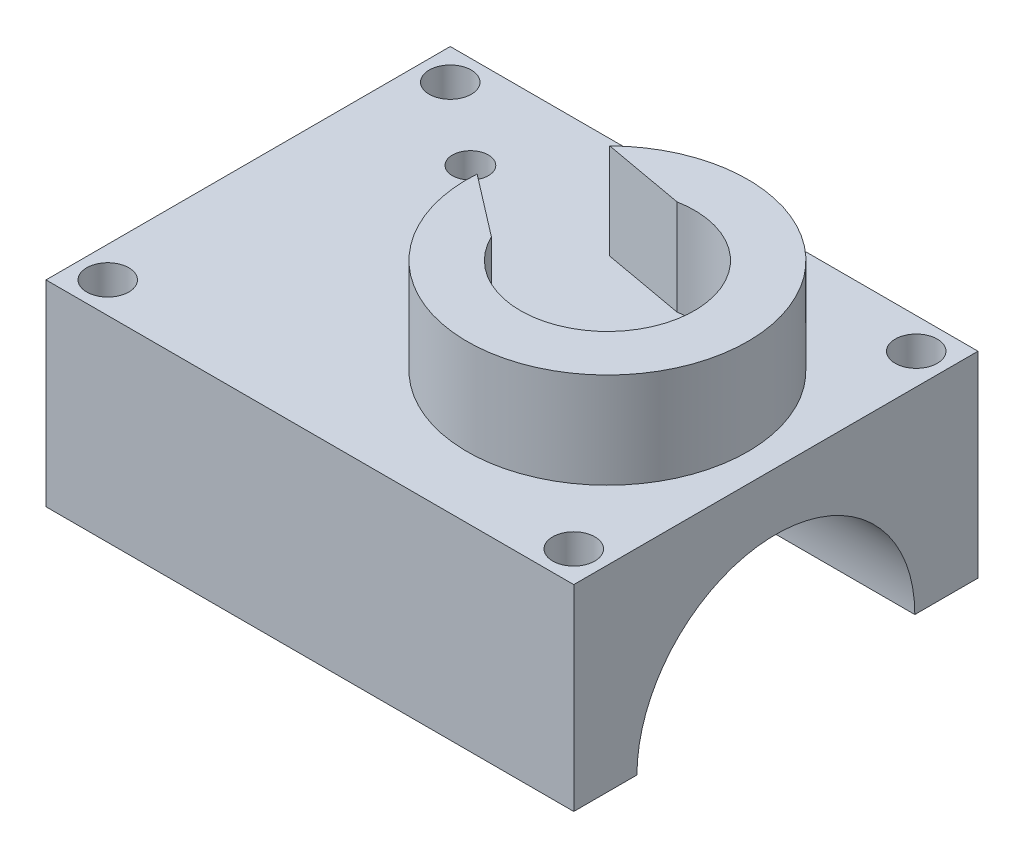
ISO-10303-21;
HEADER;
FILE_DESCRIPTION(('STEP AP214'),'2;1');
FILE_NAME('part.step','',(''),(''),'','','');
FILE_SCHEMA(('AUTOMOTIVE_DESIGN { 1 0 10303 214 1 1 1 1 }'));
ENDSEC;
DATA;
#1=APPLICATION_CONTEXT('core data for automotive mechanical design processes');
#2=APPLICATION_PROTOCOL_DEFINITION('international standard','automotive_design',2000,#1);
#3=PRODUCT_CONTEXT('',#1,'mechanical');
#4=PRODUCT('Part','Part','',(#3));
#5=PRODUCT_RELATED_PRODUCT_CATEGORY('part','',(#4));
#6=PRODUCT_DEFINITION_FORMATION('','',#4);
#7=PRODUCT_DEFINITION_CONTEXT('part definition',#1,'design');
#8=PRODUCT_DEFINITION('design','',#6,#7);
#9=PRODUCT_DEFINITION_SHAPE('','',#8);
#10=(LENGTH_UNIT() NAMED_UNIT(*) SI_UNIT(.MILLI.,.METRE.));
#11=(NAMED_UNIT(*) PLANE_ANGLE_UNIT() SI_UNIT($,.RADIAN.));
#12=(NAMED_UNIT(*) SI_UNIT($,.STERADIAN.) SOLID_ANGLE_UNIT());
#13=UNCERTAINTY_MEASURE_WITH_UNIT(LENGTH_MEASURE(1.E-05),#10,'distance_accuracy_value','');
#14=(GEOMETRIC_REPRESENTATION_CONTEXT(3) GLOBAL_UNCERTAINTY_ASSIGNED_CONTEXT((#13)) GLOBAL_UNIT_ASSIGNED_CONTEXT((#10,
#11,#12)) REPRESENTATION_CONTEXT('',''));
#15=CARTESIAN_POINT('',(0.,0.,0.));
#16=DIRECTION('',(0.,0.,1.));
#17=DIRECTION('',(1.,0.,0.));
#18=AXIS2_PLACEMENT_3D('',#15,#16,#17);
#19=CARTESIAN_POINT('',(-30.,35.,-18.));
#20=DIRECTION('',(0.,0.,1.));
#21=DIRECTION('',(1.,0.,0.));
#22=AXIS2_PLACEMENT_3D('',#19,#20,#21);
#23=PLANE('',#22);
#24=DIRECTION('',(0.,-1.,0.));
#25=VECTOR('',#24,1.);
#26=CARTESIAN_POINT('',(-17.,35.,-18.));
#27=LINE('',#26,#25);
#28=CARTESIAN_POINT('',(-17.,35.,-18.));
#29=VERTEX_POINT('',#28);
#30=CARTESIAN_POINT('',(-17.,17.5,-18.));
#31=VERTEX_POINT('',#30);
#32=EDGE_CURVE('E297',#29,#31,#27,.T.);
#33=ORIENTED_EDGE('',*,*,#32,.F.);
#34=DIRECTION('',(-1.,0.,0.));
#35=VECTOR('',#34,1.);
#36=CARTESIAN_POINT('',(-30.,35.,-18.));
#37=LINE('',#36,#35);
#38=CARTESIAN_POINT('',(30.,35.,-18.));
#39=VERTEX_POINT('',#38);
#40=EDGE_CURVE('E204',#39,#29,#37,.T.);
#41=ORIENTED_EDGE('',*,*,#40,.F.);
#42=DIRECTION('',(0.,-1.,0.));
#43=VECTOR('',#42,1.);
#44=CARTESIAN_POINT('',(30.,35.,-18.));
#45=LINE('',#44,#43);
#46=CARTESIAN_POINT('',(30.,17.5,-18.));
#47=VERTEX_POINT('',#46);
#48=EDGE_CURVE('E210',#39,#47,#45,.T.);
#49=ORIENTED_EDGE('',*,*,#48,.T.);
#50=DIRECTION('',(1.,0.,0.));
#51=VECTOR('',#50,1.);
#52=CARTESIAN_POINT('',(-30.,17.5,-18.));
#53=LINE('',#52,#51);
#54=EDGE_CURVE('E164',#31,#47,#53,.T.);
#55=ORIENTED_EDGE('',*,*,#54,.F.);
#56=EDGE_LOOP('',(#33,#41,#49,#55));
#57=FACE_BOUND('',#56,.T.);
#58=ADVANCED_FACE('F47',(#57),#23,.F.);
#59=CARTESIAN_POINT('',(-30.,35.,18.));
#60=DIRECTION('',(0.,0.,-1.));
#61=DIRECTION('',(-1.,0.,0.));
#62=AXIS2_PLACEMENT_3D('',#59,#60,#61);
#63=PLANE('',#62);
#64=DIRECTION('',(0.,1.,0.));
#65=VECTOR('',#64,1.);
#66=CARTESIAN_POINT('',(-17.,35.,18.));
#67=LINE('',#66,#65);
#68=CARTESIAN_POINT('',(-17.,17.5,18.));
#69=VERTEX_POINT('',#68);
#70=CARTESIAN_POINT('',(-17.,35.,18.));
#71=VERTEX_POINT('',#70);
#72=EDGE_CURVE('E146',#69,#71,#67,.T.);
#73=ORIENTED_EDGE('',*,*,#72,.F.);
#74=DIRECTION('',(1.,0.,0.));
#75=VECTOR('',#74,1.);
#76=CARTESIAN_POINT('',(-30.,17.5,18.));
#77=LINE('',#76,#75);
#78=CARTESIAN_POINT('',(30.,17.5,18.));
#79=VERTEX_POINT('',#78);
#80=EDGE_CURVE('E155',#69,#79,#77,.T.);
#81=ORIENTED_EDGE('',*,*,#80,.T.);
#82=DIRECTION('',(0.,-1.,0.));
#83=VECTOR('',#82,1.);
#84=CARTESIAN_POINT('',(30.,35.,18.));
#85=LINE('',#84,#83);
#86=CARTESIAN_POINT('',(30.,35.,18.));
#87=VERTEX_POINT('',#86);
#88=EDGE_CURVE('E208',#87,#79,#85,.T.);
#89=ORIENTED_EDGE('',*,*,#88,.F.);
#90=DIRECTION('',(1.,0.,0.));
#91=VECTOR('',#90,1.);
#92=CARTESIAN_POINT('',(-30.,35.,18.));
#93=LINE('',#92,#91);
#94=EDGE_CURVE('E157',#71,#87,#93,.T.);
#95=ORIENTED_EDGE('',*,*,#94,.F.);
#96=EDGE_LOOP('',(#73,#81,#89,#95));
#97=FACE_BOUND('',#96,.T.);
#98=ADVANCED_FACE('F153',(#97),#63,.F.);
#99=CARTESIAN_POINT('',(0.,35.,0.));
#100=DIRECTION('',(0.,-1.,0.));
#101=DIRECTION('',(0.,0.,-1.));
#102=AXIS2_PLACEMENT_3D('',#99,#100,#101);
#103=PLANE('',#102);
#104=CARTESIAN_POINT('',(-14.25,35.,15.25));
#105=DIRECTION('',(0.,1.,0.));
#106=DIRECTION('',(0.,0.,-1.));
#107=AXIS2_PLACEMENT_3D('',#104,#105,#106);
#108=CIRCLE('',#107,1.875);
#109=CARTESIAN_POINT('',(-14.25,35.,13.375));
#110=VERTEX_POINT('',#109);
#111=EDGE_CURVE('E193',#110,#110,#108,.T.);
#112=ORIENTED_EDGE('',*,*,#111,.F.);
#113=EDGE_LOOP('',(#112));
#114=FACE_BOUND('',#113,.T.);
#115=CARTESIAN_POINT('',(27.25,35.,-15.25));
#116=DIRECTION('',(0.,1.,0.));
#117=DIRECTION('',(0.,0.,-1.));
#118=AXIS2_PLACEMENT_3D('',#115,#116,#117);
#119=CIRCLE('',#118,1.87500000000001);
#120=CARTESIAN_POINT('',(27.25,35.,-17.125));
#121=VERTEX_POINT('',#120);
#122=EDGE_CURVE('E186',#121,#121,#119,.T.);
#123=ORIENTED_EDGE('',*,*,#122,.F.);
#124=EDGE_LOOP('',(#123));
#125=FACE_BOUND('',#124,.T.);
#126=CARTESIAN_POINT('',(27.25,35.,15.25));
#127=DIRECTION('',(0.,1.,0.));
#128=DIRECTION('',(0.,0.,1.));
#129=AXIS2_PLACEMENT_3D('',#126,#127,#128);
#130=CIRCLE('',#129,1.875);
#131=CARTESIAN_POINT('',(27.25,35.,17.125));
#132=VERTEX_POINT('',#131);
#133=EDGE_CURVE('E189',#132,#132,#130,.T.);
#134=ORIENTED_EDGE('',*,*,#133,.F.);
#135=EDGE_LOOP('',(#134));
#136=FACE_BOUND('',#135,.T.);
#137=CARTESIAN_POINT('',(-14.25,35.,-15.25));
#138=DIRECTION('',(0.,1.,0.));
#139=DIRECTION('',(0.,0.,1.));
#140=AXIS2_PLACEMENT_3D('',#137,#138,#139);
#141=CIRCLE('',#140,1.87500000000001);
#142=CARTESIAN_POINT('',(-14.25,35.,-13.375));
#143=VERTEX_POINT('',#142);
#144=EDGE_CURVE('E190',#143,#143,#141,.T.);
#145=ORIENTED_EDGE('',*,*,#144,.F.);
#146=EDGE_LOOP('',(#145));
#147=FACE_BOUND('',#146,.T.);
#148=CARTESIAN_POINT('',(-6.93780068742045,35.,-9.73308281065229));
#149=DIRECTION('',(0.,1.,0.));
#150=DIRECTION('',(0.,0.,1.));
#151=AXIS2_PLACEMENT_3D('',#148,#149,#150);
#152=CIRCLE('',#151,1.6);
#153=CARTESIAN_POINT('',(-6.93780068742045,35.,-8.13308281065229));
#154=VERTEX_POINT('',#153);
#155=EDGE_CURVE('E287',#154,#154,#152,.T.);
#156=ORIENTED_EDGE('',*,*,#155,.F.);
#157=EDGE_LOOP('',(#156));
#158=FACE_BOUND('',#157,.T.);
#159=DIRECTION('',(-0.984099357112576,0.,-0.177618848466636));
#160=VECTOR('',#159,1.);
#161=CARTESIAN_POINT('',(-6.31746052441174,35.,-11.2079313052979));
#162=LINE('',#161,#160);
#163=CARTESIAN_POINT('',(13.5741859363366,35.,-7.61771319070623));
#164=VERTEX_POINT('',#163);
#165=CARTESIAN_POINT('',(6.26109190714302,35.,-8.93764428384788));
#166=VERTEX_POINT('',#165);
#167=EDGE_CURVE('E291',#164,#166,#162,.T.);
#168=ORIENTED_EDGE('',*,*,#167,.T.);
#169=CARTESIAN_POINT('',(15.,35.,0.));
#170=DIRECTION('',(0.,-1.,0.));
#171=DIRECTION('',(0.,0.,-1.));
#172=AXIS2_PLACEMENT_3D('',#169,#170,#171);
#173=CIRCLE('',#172,12.5);
#174=CARTESIAN_POINT('',(2.52983012282543,35.,-0.863054595265051));
#175=VERTEX_POINT('',#174);
#176=EDGE_CURVE('E383',#175,#166,#173,.F.);
#177=ORIENTED_EDGE('',*,*,#176,.F.);
#178=DIRECTION('',(0.79314049072422,0.,0.609038719601426));
#179=VECTOR('',#178,1.);
#180=CARTESIAN_POINT('',(-6.93780068742045,35.,-8.13308281065229));
#181=LINE('',#180,#179);
#182=CARTESIAN_POINT('',(8.00854236660578,35.,3.34395277485401));
#183=VERTEX_POINT('',#182);
#184=EDGE_CURVE('E69',#175,#183,#181,.T.);
#185=ORIENTED_EDGE('',*,*,#184,.T.);
#186=CARTESIAN_POINT('',(15.,35.,0.));
#187=DIRECTION('',(0.,1.,0.));
#188=DIRECTION('',(0.,0.,1.));
#189=AXIS2_PLACEMENT_3D('',#186,#187,#188);
#190=CIRCLE('',#189,7.75);
#191=EDGE_CURVE('E317',#183,#164,#190,.T.);
#192=ORIENTED_EDGE('',*,*,#191,.T.);
#193=EDGE_LOOP('',(#168,#177,#185,#192));
#194=FACE_BOUND('',#193,.T.);
#195=CARTESIAN_POINT('',(15.,35.,0.));
#196=DIRECTION('',(0.,-1.,0.));
#197=DIRECTION('',(0.,0.,-1.));
#198=AXIS2_PLACEMENT_3D('',#195,#196,#197);
#199=CIRCLE('',#198,1.6);
#200=CARTESIAN_POINT('',(15.,35.,-1.6));
#201=VERTEX_POINT('',#200);
#202=EDGE_CURVE('E225',#201,#201,#199,.T.);
#203=ORIENTED_EDGE('',*,*,#202,.T.);
#204=EDGE_LOOP('',(#203));
#205=FACE_BOUND('',#204,.T.);
#206=DIRECTION('',(0.,0.,-1.));
#207=VECTOR('',#206,1.);
#208=CARTESIAN_POINT('',(-17.,35.,0.));
#209=LINE('',#208,#207);
#210=EDGE_CURVE('E296',#71,#29,#209,.T.);
#211=ORIENTED_EDGE('',*,*,#210,.F.);
#212=ORIENTED_EDGE('',*,*,#94,.T.);
#213=DIRECTION('',(0.,0.,-1.));
#214=VECTOR('',#213,1.);
#215=CARTESIAN_POINT('',(30.,35.,18.));
#216=LINE('',#215,#214);
#217=EDGE_CURVE('E201',#87,#39,#216,.T.);
#218=ORIENTED_EDGE('',*,*,#217,.T.);
#219=ORIENTED_EDGE('',*,*,#40,.T.);
#220=EDGE_LOOP('',(#211,#212,#218,#219));
#221=FACE_BOUND('',#220,.T.);
#222=ADVANCED_FACE('F268',(#114,#125,#136,#147,#158,#194,#205,#221),#103,.F.);
#223=CARTESIAN_POINT('',(-30.,17.5,0.));
#224=DIRECTION('',(1.,0.,0.));
#225=DIRECTION('',(0.,0.,-1.));
#226=AXIS2_PLACEMENT_3D('',#223,#224,#225);
#227=CYLINDRICAL_SURFACE('',#226,12.375);
#228=CARTESIAN_POINT('',(15.,29.5340101379382,-2.885));
#229=CARTESIAN_POINT('',(14.8403290783683,29.534013330723,-2.88499490173287));
#230=CARTESIAN_POINT('',(14.6805991342776,29.5372226374159,-2.87169934923319));
#231=CARTESIAN_POINT('',(14.3657014366662,29.5496854773321,-2.81893835112755));
#232=CARTESIAN_POINT('',(14.2105367638147,29.5589429984039,-2.77945563893693));
#233=CARTESIAN_POINT('',(13.9093700045626,29.5823981112321,-2.67564742877025));
#234=CARTESIAN_POINT('',(13.7633573161208,29.5965898572948,-2.61135131794787));
#235=CARTESIAN_POINT('',(13.4841821220057,29.6283072353214,-2.4598281164135));
#236=CARTESIAN_POINT('',(13.3510197172738,29.6458328934704,-2.37260084559319));
#237=CARTESIAN_POINT('',(13.098772537658,29.6826189610307,-2.17590796215374));
#238=CARTESIAN_POINT('',(12.979970093371,29.7019040718922,-2.06608483033001));
#239=CARTESIAN_POINT('',(12.7622943639026,29.7398207435714,-1.82808877246084));
#240=CARTESIAN_POINT('',(12.6634227624512,29.7584522490638,-1.69991429768239));
#241=CARTESIAN_POINT('',(12.4872813864765,29.79323340834,-1.42694248903819));
#242=CARTESIAN_POINT('',(12.4102857674632,29.809350511921,-1.28196374483246));
#243=CARTESIAN_POINT('',(12.281859589753,29.8370066412362,-0.98068494495937));
#244=CARTESIAN_POINT('',(12.2304257634973,29.8485462520722,-0.824386339235661));
#245=CARTESIAN_POINT('',(12.1554784788291,29.8655726086653,-0.507843852941573));
#246=CARTESIAN_POINT('',(12.1314864330716,29.8711629852995,-0.347718955998159));
#247=CARTESIAN_POINT('',(12.1106047816844,29.8760209672482,-0.0256259550440856));
#248=CARTESIAN_POINT('',(12.1137116719453,29.875289390042,0.136341907951378));
#249=CARTESIAN_POINT('',(12.1465886915227,29.8676641796498,0.454215052496489));
#250=CARTESIAN_POINT('',(12.1758426513784,29.8608898417953,0.610177007509724));
#251=CARTESIAN_POINT('',(12.2593576939323,29.8420774941503,0.914914728618146));
#252=CARTESIAN_POINT('',(12.3136200028653,29.8300392262548,1.06369014194028));
#253=CARTESIAN_POINT('',(12.446050494671,29.801863934318,1.35123188466526));
#254=CARTESIAN_POINT('',(12.5244089739195,29.7856944630647,1.48990726123099));
#255=CARTESIAN_POINT('',(12.7026645660478,29.7510214337998,1.75232545861638));
#256=CARTESIAN_POINT('',(12.8025649807702,29.7325175181566,1.87606598575529));
#257=CARTESIAN_POINT('',(13.0238600507216,29.6946870455019,2.10817619953594));
#258=CARTESIAN_POINT('',(13.1457062564299,29.6753513798745,2.21611430817536));
#259=CARTESIAN_POINT('',(13.4059721416776,29.63844145222,2.4101128944092));
#260=CARTESIAN_POINT('',(13.5443924030102,29.6208672520649,2.49617260368256));
#261=CARTESIAN_POINT('',(13.8346405703438,29.5894418768931,2.64420016193607));
#262=CARTESIAN_POINT('',(13.9865167386292,29.5756048885923,2.70607659590089));
#263=CARTESIAN_POINT('',(14.2989129487144,29.5534098326218,2.80329257371181));
#264=CARTESIAN_POINT('',(14.4594314044945,29.5450507633364,2.83863696900744));
#265=CARTESIAN_POINT('',(14.7805858465601,29.534965010041,2.88109557743742));
#266=CARTESIAN_POINT('',(14.9411336151261,29.5330897040742,2.88884251257696));
#267=CARTESIAN_POINT('',(15.2612269310516,29.5357812663334,2.87760788692816));
#268=CARTESIAN_POINT('',(15.4207725564968,29.5403476262193,2.85862843523725));
#269=CARTESIAN_POINT('',(15.7320650895613,29.5552667207741,2.79503144324121));
#270=CARTESIAN_POINT('',(15.8838892153943,29.56553876906,2.75077116722028));
#271=CARTESIAN_POINT('',(16.1779654997739,29.5906373540794,2.63825983426755));
#272=CARTESIAN_POINT('',(16.3202166402891,29.6054643742777,2.57000623057311));
#273=CARTESIAN_POINT('',(16.5938216735157,29.6383227262856,2.41008293791368));
#274=CARTESIAN_POINT('',(16.7249444726909,29.6564050545638,2.31802858254649));
#275=CARTESIAN_POINT('',(16.9701139340845,29.693606375162,2.11361257761502));
#276=CARTESIAN_POINT('',(17.0841581677716,29.7127255143886,2.00124804499597));
#277=CARTESIAN_POINT('',(17.2944365935378,29.7503422867359,1.75651982603345));
#278=CARTESIAN_POINT('',(17.3902365548706,29.7688178087208,1.62377903537295));
#279=CARTESIAN_POINT('',(17.5581804162691,29.8026377958843,1.34372319381795));
#280=CARTESIAN_POINT('',(17.6303254914707,29.8179824165866,1.19640886738621));
#281=CARTESIAN_POINT('',(17.7483308280084,29.8437195498961,0.892360514485398));
#282=CARTESIAN_POINT('',(17.7943692082165,29.854145536822,0.735698582949505));
#283=CARTESIAN_POINT('',(17.8594020920382,29.8690162739875,0.416590481353656));
#284=CARTESIAN_POINT('',(17.878401094331,29.8734620191837,0.254145278097031));
#285=CARTESIAN_POINT('',(17.8885908216136,29.8758368696912,-0.067815611239718));
#286=CARTESIAN_POINT('',(17.8804263978302,29.8739170941747,-0.227310106596556));
#287=CARTESIAN_POINT('',(17.8379788203858,29.8641054266419,-0.54258713351675));
#288=CARTESIAN_POINT('',(17.8036962660715,29.856213671668,-0.698369750173991));
#289=CARTESIAN_POINT('',(17.7103117389502,29.8353614929274,-1.00122317159058));
#290=CARTESIAN_POINT('',(17.6513125376116,29.8224220724417,-1.14832720503001));
#291=CARTESIAN_POINT('',(17.5102657009942,29.7928473740463,-1.43062802691732));
#292=CARTESIAN_POINT('',(17.4282155142212,29.7762116870426,-1.56582349503878));
#293=CARTESIAN_POINT('',(17.2413536025263,29.740608516578,-1.82357696180435));
#294=CARTESIAN_POINT('',(17.1360953209811,29.7215990008404,-1.9458054368098));
#295=CARTESIAN_POINT('',(16.9066910444062,29.6835996586578,-2.17108397217673));
#296=CARTESIAN_POINT('',(16.7825404113233,29.6646098382037,-2.2741293092478));
#297=CARTESIAN_POINT('',(16.5165367923883,29.6284654497227,-2.45968479525675));
#298=CARTESIAN_POINT('',(16.3744371396181,29.6113442601251,-2.54184827469139));
#299=CARTESIAN_POINT('',(16.0780701226495,29.5813073463044,-2.68099656170731));
#300=CARTESIAN_POINT('',(15.9238125406776,29.5683882831233,-2.73800137297497));
#301=CARTESIAN_POINT('',(15.6413140283395,29.5504449373968,-2.81577987298684));
#302=CARTESIAN_POINT('',(15.5145306262997,29.5443251576512,-2.84168470892808));
#303=CARTESIAN_POINT('',(15.2585109422719,29.5361065925551,-2.87629629257412));
#304=CARTESIAN_POINT('',(15.1292748159026,29.534007552955,-2.8850041277243));
#305=CARTESIAN_POINT('',(15.,29.5340101379382,-2.885));
#306=B_SPLINE_CURVE_WITH_KNOTS('',3,(#228,#229,#230,#231,#232,#233,#234,#235,#236,#237,#238,
#239,#240,#241,#242,#243,#244,#245,#246,#247,#248,#249,#250,#251,#252,#253,#254,#255,#256,#257,
#258,#259,#260,#261,#262,#263,#264,#265,#266,#267,#268,#269,#270,#271,#272,#273,#274,#275,#276,
#277,#278,#279,#280,#281,#282,#283,#284,#285,#286,#287,#288,#289,#290,#291,#292,#293,#294,#295,
#296,#297,#298,#299,#300,#301,#302,#303,#304,#305),.UNSPECIFIED.,.T.,.F.,(4,2,2,2,2,2,2,2,2,2,2,
2,2,2,2,2,2,2,2,2,2,2,2,2,2,2,2,2,2,2,2,2,2,2,2,2,2,2,4),(0.,0.478538575241951,
0.957392990458654,1.43568201774427,1.91397480176988,2.40051473804439,2.88709575932839,
3.37952987843808,3.87190103359293,4.35554758760227,4.83913160316743,5.31337501448127,
5.7876416818541,6.26575441882256,6.74394049073243,7.23340967179636,7.7228960395628,
8.21421521734421,8.70544453428886,9.18533633622673,9.66519026990164,10.1384250766732,
10.611710129948,11.0931829190649,11.5747241075905,12.0665886976885,12.5584288490578,
13.0468716375632,13.5352331518471,14.0120846216321,14.4889251491792,14.9638023562733,
15.4387321478535,15.9237523427315,16.4088918022472,16.9016248313121,17.3939653788521,
17.7814304090406,18.1688709372504),.UNSPECIFIED.);
#307=CARTESIAN_POINT('',(15.,29.5340101379382,-2.885));
#308=VERTEX_POINT('',#307);
#309=EDGE_CURVE('E216',#308,#308,#306,.T.);
#310=ORIENTED_EDGE('',*,*,#309,.T.);
#311=EDGE_LOOP('',(#310));
#312=FACE_BOUND('',#311,.T.);
#313=CARTESIAN_POINT('',(-17.,17.5,0.));
#314=DIRECTION('',(-1.,0.,0.));
#315=DIRECTION('',(0.,0.,1.));
#316=AXIS2_PLACEMENT_3D('',#313,#314,#315);
#317=CIRCLE('',#316,12.375);
#318=CARTESIAN_POINT('',(-17.,17.5,-12.375));
#319=VERTEX_POINT('',#318);
#320=CARTESIAN_POINT('',(-17.,17.5,12.375));
#321=VERTEX_POINT('',#320);
#322=EDGE_CURVE('E61',#319,#321,#317,.F.);
#323=ORIENTED_EDGE('',*,*,#322,.F.);
#324=DIRECTION('',(1.,0.,0.));
#325=VECTOR('',#324,1.);
#326=CARTESIAN_POINT('',(-30.,17.5,-12.375));
#327=LINE('',#326,#325);
#328=CARTESIAN_POINT('',(-9.80460620186028,17.5,-12.375));
#329=VERTEX_POINT('',#328);
#330=EDGE_CURVE('E182',#319,#329,#327,.T.);
#331=ORIENTED_EDGE('',*,*,#330,.T.);
#332=CARTESIAN_POINT('',(-9.80460620186028,17.5,0.));
#333=DIRECTION('',(-1.,0.,0.));
#334=DIRECTION('',(0.,0.,1.));
#335=AXIS2_PLACEMENT_3D('',#332,#333,#334);
#336=CIRCLE('',#335,12.375);
#337=CARTESIAN_POINT('',(-9.80460620186028,28.5506706564583,-5.56985664469849));
#338=VERTEX_POINT('',#337);
#339=EDGE_CURVE('E379',#329,#338,#336,.F.);
#340=ORIENTED_EDGE('',*,*,#339,.T.);
#341=DIRECTION('',(1.,0.,0.));
#342=VECTOR('',#341,1.);
#343=CARTESIAN_POINT('',(-30.,28.5506706564583,-5.56985664469849));
#344=LINE('',#343,#342);
#345=CARTESIAN_POINT('',(-4.10460620186028,28.5506706564583,-5.56985664469849));
#346=VERTEX_POINT('',#345);
#347=EDGE_CURVE('E376',#338,#346,#344,.T.);
#348=ORIENTED_EDGE('',*,*,#347,.T.);
#349=CARTESIAN_POINT('',(-4.10460620186028,17.5,0.));
#350=DIRECTION('',(1.,0.,0.));
#351=DIRECTION('',(0.,0.,-1.));
#352=AXIS2_PLACEMENT_3D('',#349,#350,#351);
#353=CIRCLE('',#352,12.375);
#354=CARTESIAN_POINT('',(-4.10460620186028,17.5,-12.375));
#355=VERTEX_POINT('',#354);
#356=EDGE_CURVE('E213',#346,#355,#353,.F.);
#357=ORIENTED_EDGE('',*,*,#356,.T.);
#358=CARTESIAN_POINT('',(30.,17.5,-12.375));
#359=VERTEX_POINT('',#358);
#360=EDGE_CURVE('E181',#355,#359,#327,.T.);
#361=ORIENTED_EDGE('',*,*,#360,.T.);
#362=CARTESIAN_POINT('',(30.,17.5,0.));
#363=DIRECTION('',(1.,0.,0.));
#364=DIRECTION('',(0.,0.,-1.));
#365=AXIS2_PLACEMENT_3D('',#362,#363,#364);
#366=CIRCLE('',#365,12.375);
#367=CARTESIAN_POINT('',(30.,17.5,12.375));
#368=VERTEX_POINT('',#367);
#369=EDGE_CURVE('E198',#359,#368,#366,.T.);
#370=ORIENTED_EDGE('',*,*,#369,.T.);
#371=DIRECTION('',(1.,0.,0.));
#372=VECTOR('',#371,1.);
#373=CARTESIAN_POINT('',(-30.,17.5,12.375));
#374=LINE('',#373,#372);
#375=EDGE_CURVE('E184',#368,#321,#374,.F.);
#376=ORIENTED_EDGE('',*,*,#375,.T.);
#377=EDGE_LOOP('',(#323,#331,#340,#348,#357,#361,#370,#376));
#378=FACE_BOUND('',#377,.T.);
#379=ADVANCED_FACE('F227',(#312,#378),#227,.F.);
#380=CARTESIAN_POINT('',(-30.,17.5,18.));
#381=DIRECTION('',(0.,1.,0.));
#382=DIRECTION('',(0.,0.,1.));
#383=AXIS2_PLACEMENT_3D('',#380,#381,#382);
#384=PLANE('',#383);
#385=CARTESIAN_POINT('',(27.25,17.5,-15.25));
#386=DIRECTION('',(0.,1.,0.));
#387=DIRECTION('',(0.,0.,1.));
#388=AXIS2_PLACEMENT_3D('',#385,#386,#387);
#389=CIRCLE('',#388,1.87500000000001);
#390=CARTESIAN_POINT('',(27.25,17.5,-13.375));
#391=VERTEX_POINT('',#390);
#392=EDGE_CURVE('E175',#391,#391,#389,.F.);
#393=ORIENTED_EDGE('',*,*,#392,.F.);
#394=EDGE_LOOP('',(#393));
#395=FACE_BOUND('',#394,.T.);
#396=CARTESIAN_POINT('',(-14.25,17.5,-15.25));
#397=DIRECTION('',(0.,1.,0.));
#398=DIRECTION('',(0.,0.,1.));
#399=AXIS2_PLACEMENT_3D('',#396,#397,#398);
#400=CIRCLE('',#399,1.87500000000001);
#401=CARTESIAN_POINT('',(-14.25,17.5,-13.375));
#402=VERTEX_POINT('',#401);
#403=EDGE_CURVE('E167',#402,#402,#400,.F.);
#404=ORIENTED_EDGE('',*,*,#403,.F.);
#405=EDGE_LOOP('',(#404));
#406=FACE_BOUND('',#405,.T.);
#407=DIRECTION('',(0.,0.,1.));
#408=VECTOR('',#407,1.);
#409=CARTESIAN_POINT('',(-17.,17.5,18.));
#410=LINE('',#409,#408);
#411=EDGE_CURVE('E158',#31,#319,#410,.T.);
#412=ORIENTED_EDGE('',*,*,#411,.F.);
#413=ORIENTED_EDGE('',*,*,#54,.T.);
#414=DIRECTION('',(0.,0.,1.));
#415=VECTOR('',#414,1.);
#416=CARTESIAN_POINT('',(30.,17.5,18.));
#417=LINE('',#416,#415);
#418=EDGE_CURVE('E165',#47,#359,#417,.T.);
#419=ORIENTED_EDGE('',*,*,#418,.T.);
#420=ORIENTED_EDGE('',*,*,#360,.F.);
#421=DIRECTION('',(1.,0.,0.));
#422=VECTOR('',#421,1.);
#423=CARTESIAN_POINT('',(-9.80460620186028,17.5,-12.375));
#424=LINE('',#423,#422);
#425=EDGE_CURVE('E324',#329,#355,#424,.T.);
#426=ORIENTED_EDGE('',*,*,#425,.F.);
#427=ORIENTED_EDGE('',*,*,#330,.F.);
#428=EDGE_LOOP('',(#412,#413,#419,#420,#426,#427));
#429=FACE_BOUND('',#428,.T.);
#430=ADVANCED_FACE('F240',(#395,#406,#429),#384,.F.);
#431=CARTESIAN_POINT('',(-14.25,17.5,15.25));
#432=DIRECTION('',(0.,1.,0.));
#433=DIRECTION('',(0.,0.,1.));
#434=AXIS2_PLACEMENT_3D('',#431,#432,#433);
#435=CIRCLE('',#434,1.875);
#436=CARTESIAN_POINT('',(-14.25,17.5,17.125));
#437=VERTEX_POINT('',#436);
#438=EDGE_CURVE('E178',#437,#437,#435,.F.);
#439=ORIENTED_EDGE('',*,*,#438,.F.);
#440=EDGE_LOOP('',(#439));
#441=FACE_BOUND('',#440,.T.);
#442=CARTESIAN_POINT('',(27.25,17.5,15.25));
#443=DIRECTION('',(0.,1.,0.));
#444=DIRECTION('',(0.,0.,1.));
#445=AXIS2_PLACEMENT_3D('',#442,#443,#444);
#446=CIRCLE('',#445,1.875);
#447=CARTESIAN_POINT('',(27.25,17.5,17.125));
#448=VERTEX_POINT('',#447);
#449=EDGE_CURVE('E172',#448,#448,#446,.F.);
#450=ORIENTED_EDGE('',*,*,#449,.F.);
#451=EDGE_LOOP('',(#450));
#452=FACE_BOUND('',#451,.T.);
#453=DIRECTION('',(0.,0.,1.));
#454=VECTOR('',#453,1.);
#455=CARTESIAN_POINT('',(-17.,17.5,18.));
#456=LINE('',#455,#454);
#457=EDGE_CURVE('E11',#321,#69,#456,.T.);
#458=ORIENTED_EDGE('',*,*,#457,.F.);
#459=ORIENTED_EDGE('',*,*,#375,.F.);
#460=EDGE_CURVE('E162',#368,#79,#417,.T.);
#461=ORIENTED_EDGE('',*,*,#460,.T.);
#462=ORIENTED_EDGE('',*,*,#80,.F.);
#463=EDGE_LOOP('',(#458,#459,#461,#462));
#464=FACE_BOUND('',#463,.T.);
#465=ADVANCED_FACE('F160',(#441,#452,#464),#384,.F.);
#466=CARTESIAN_POINT('',(30.,35.,18.));
#467=DIRECTION('',(-1.,0.,0.));
#468=DIRECTION('',(0.,0.,1.));
#469=AXIS2_PLACEMENT_3D('',#466,#467,#468);
#470=PLANE('',#469);
#471=ORIENTED_EDGE('',*,*,#88,.T.);
#472=ORIENTED_EDGE('',*,*,#460,.F.);
#473=ORIENTED_EDGE('',*,*,#369,.F.);
#474=ORIENTED_EDGE('',*,*,#418,.F.);
#475=ORIENTED_EDGE('',*,*,#48,.F.);
#476=ORIENTED_EDGE('',*,*,#217,.F.);
#477=EDGE_LOOP('',(#471,#472,#473,#474,#475,#476));
#478=FACE_BOUND('',#477,.T.);
#479=ADVANCED_FACE('F49',(#478),#470,.F.);
#480=CARTESIAN_POINT('',(-14.25,-5.,15.25));
#481=DIRECTION('',(0.,1.,0.));
#482=DIRECTION('',(0.,0.,1.));
#483=AXIS2_PLACEMENT_3D('',#480,#481,#482);
#484=CYLINDRICAL_SURFACE('',#483,1.875);
#485=ORIENTED_EDGE('',*,*,#438,.T.);
#486=EDGE_LOOP('',(#485));
#487=FACE_BOUND('',#486,.T.);
#488=ORIENTED_EDGE('',*,*,#111,.T.);
#489=EDGE_LOOP('',(#488));
#490=FACE_BOUND('',#489,.T.);
#491=ADVANCED_FACE('F248',(#487,#490),#484,.F.);
#492=CARTESIAN_POINT('',(27.25,-5.,-15.25));
#493=DIRECTION('',(0.,1.,0.));
#494=DIRECTION('',(0.,0.,1.));
#495=AXIS2_PLACEMENT_3D('',#492,#493,#494);
#496=CYLINDRICAL_SURFACE('',#495,1.87500000000001);
#497=ORIENTED_EDGE('',*,*,#392,.T.);
#498=EDGE_LOOP('',(#497));
#499=FACE_BOUND('',#498,.T.);
#500=ORIENTED_EDGE('',*,*,#122,.T.);
#501=EDGE_LOOP('',(#500));
#502=FACE_BOUND('',#501,.T.);
#503=ADVANCED_FACE('F244',(#499,#502),#496,.F.);
#504=CARTESIAN_POINT('',(27.25,-5.,15.25));
#505=DIRECTION('',(0.,1.,0.));
#506=DIRECTION('',(0.,0.,1.));
#507=AXIS2_PLACEMENT_3D('',#504,#505,#506);
#508=CYLINDRICAL_SURFACE('',#507,1.875);
#509=ORIENTED_EDGE('',*,*,#449,.T.);
#510=EDGE_LOOP('',(#509));
#511=FACE_BOUND('',#510,.T.);
#512=ORIENTED_EDGE('',*,*,#133,.T.);
#513=EDGE_LOOP('',(#512));
#514=FACE_BOUND('',#513,.T.);
#515=ADVANCED_FACE('F247',(#511,#514),#508,.F.);
#516=CARTESIAN_POINT('',(-14.25,-5.,-15.25));
#517=DIRECTION('',(0.,1.,0.));
#518=DIRECTION('',(0.,0.,1.));
#519=AXIS2_PLACEMENT_3D('',#516,#517,#518);
#520=CYLINDRICAL_SURFACE('',#519,1.87500000000001);
#521=ORIENTED_EDGE('',*,*,#403,.T.);
#522=EDGE_LOOP('',(#521));
#523=FACE_BOUND('',#522,.T.);
#524=ORIENTED_EDGE('',*,*,#144,.T.);
#525=EDGE_LOOP('',(#524));
#526=FACE_BOUND('',#525,.T.);
#527=ADVANCED_FACE('F237',(#523,#526),#520,.F.);
#528=CARTESIAN_POINT('',(15.,31.5,0.));
#529=DIRECTION('',(0.,-1.,0.));
#530=DIRECTION('',(0.,0.,-1.));
#531=AXIS2_PLACEMENT_3D('',#528,#529,#530);
#532=CYLINDRICAL_SURFACE('',#531,2.885);
#533=CARTESIAN_POINT('',(15.,31.5,0.));
#534=DIRECTION('',(0.,-1.,0.));
#535=DIRECTION('',(0.,0.,-1.));
#536=AXIS2_PLACEMENT_3D('',#533,#534,#535);
#537=CIRCLE('',#536,2.885);
#538=CARTESIAN_POINT('',(15.,31.5,-2.885));
#539=VERTEX_POINT('',#538);
#540=EDGE_CURVE('E224',#539,#539,#537,.T.);
#541=ORIENTED_EDGE('',*,*,#540,.F.);
#542=EDGE_LOOP('',(#541));
#543=FACE_BOUND('',#542,.T.);
#544=ORIENTED_EDGE('',*,*,#309,.F.);
#545=EDGE_LOOP('',(#544));
#546=FACE_BOUND('',#545,.T.);
#547=ADVANCED_FACE('F231',(#543,#546),#532,.F.);
#548=CARTESIAN_POINT('',(15.,31.5,0.));
#549=DIRECTION('',(0.,-1.,0.));
#550=DIRECTION('',(0.,0.,-1.));
#551=AXIS2_PLACEMENT_3D('',#548,#549,#550);
#552=PLANE('',#551);
#553=CARTESIAN_POINT('',(15.,31.5,0.));
#554=DIRECTION('',(0.,-1.,0.));
#555=DIRECTION('',(0.,0.,-1.));
#556=AXIS2_PLACEMENT_3D('',#553,#554,#555);
#557=CIRCLE('',#556,1.6);
#558=CARTESIAN_POINT('',(15.,31.5,-1.6));
#559=VERTEX_POINT('',#558);
#560=EDGE_CURVE('E352',#559,#559,#557,.T.);
#561=ORIENTED_EDGE('',*,*,#560,.F.);
#562=EDGE_LOOP('',(#561));
#563=FACE_BOUND('',#562,.T.);
#564=ORIENTED_EDGE('',*,*,#540,.T.);
#565=EDGE_LOOP('',(#564));
#566=FACE_BOUND('',#565,.T.);
#567=ADVANCED_FACE('F236',(#563,#566),#552,.T.);
#568=CARTESIAN_POINT('',(15.,44.5,0.));
#569=DIRECTION('',(0.,-1.,0.));
#570=DIRECTION('',(0.,0.,-1.));
#571=AXIS2_PLACEMENT_3D('',#568,#569,#570);
#572=CYLINDRICAL_SURFACE('',#571,1.6);
#573=ORIENTED_EDGE('',*,*,#560,.T.);
#574=EDGE_LOOP('',(#573));
#575=FACE_BOUND('',#574,.T.);
#576=ORIENTED_EDGE('',*,*,#202,.F.);
#577=EDGE_LOOP('',(#576));
#578=FACE_BOUND('',#577,.T.);
#579=ADVANCED_FACE('F429',(#575,#578),#572,.F.);
#580=CARTESIAN_POINT('',(-6.93780068742045,17.5,-9.73308281065229));
#581=DIRECTION('',(0.,1.,0.));
#582=DIRECTION('',(0.,0.,1.));
#583=AXIS2_PLACEMENT_3D('',#580,#581,#582);
#584=CYLINDRICAL_SURFACE('',#583,1.6);
#585=CARTESIAN_POINT('',(-6.93780068742045,29.5,-9.73308281065229));
#586=DIRECTION('',(0.,1.,0.));
#587=DIRECTION('',(0.,0.,1.));
#588=AXIS2_PLACEMENT_3D('',#585,#586,#587);
#589=CIRCLE('',#588,1.6);
#590=CARTESIAN_POINT('',(-6.93780068742045,29.5,-8.13308281065229));
#591=VERTEX_POINT('',#590);
#592=EDGE_CURVE('E343',#591,#591,#589,.F.);
#593=ORIENTED_EDGE('',*,*,#592,.T.);
#594=EDGE_LOOP('',(#593));
#595=FACE_BOUND('',#594,.T.);
#596=ORIENTED_EDGE('',*,*,#155,.T.);
#597=EDGE_LOOP('',(#596));
#598=FACE_BOUND('',#597,.T.);
#599=ADVANCED_FACE('F427',(#595,#598),#584,.F.);
#600=CARTESIAN_POINT('',(-9.80460620186028,29.5,-12.375));
#601=DIRECTION('',(-1.,0.,0.));
#602=DIRECTION('',(0.,0.,1.));
#603=AXIS2_PLACEMENT_3D('',#600,#601,#602);
#604=PLANE('',#603);
#605=DIRECTION('',(0.,-1.,0.));
#606=VECTOR('',#605,1.);
#607=CARTESIAN_POINT('',(-9.80460620186028,29.5,-12.375));
#608=LINE('',#607,#606);
#609=CARTESIAN_POINT('',(-9.80460620186028,29.5,-12.375));
#610=VERTEX_POINT('',#609);
#611=EDGE_CURVE('E337',#610,#329,#608,.T.);
#612=ORIENTED_EDGE('',*,*,#611,.F.);
#613=DIRECTION('',(0.,0.,-1.));
#614=VECTOR('',#613,1.);
#615=CARTESIAN_POINT('',(-9.80460620186028,29.5,-12.375));
#616=LINE('',#615,#614);
#617=CARTESIAN_POINT('',(-9.80460620186028,29.5,-5.56985664469849));
#618=VERTEX_POINT('',#617);
#619=EDGE_CURVE('E325',#618,#610,#616,.T.);
#620=ORIENTED_EDGE('',*,*,#619,.F.);
#621=DIRECTION('',(0.,-1.,0.));
#622=VECTOR('',#621,1.);
#623=CARTESIAN_POINT('',(-9.80460620186028,29.5,-5.56985664469849));
#624=LINE('',#623,#622);
#625=EDGE_CURVE('E340',#618,#338,#624,.T.);
#626=ORIENTED_EDGE('',*,*,#625,.T.);
#627=ORIENTED_EDGE('',*,*,#339,.F.);
#628=EDGE_LOOP('',(#612,#620,#626,#627));
#629=FACE_BOUND('',#628,.T.);
#630=ADVANCED_FACE('F421',(#629),#604,.F.);
#631=CARTESIAN_POINT('',(-9.80460620186028,29.5,-5.56985664469849));
#632=DIRECTION('',(0.,0.,1.));
#633=DIRECTION('',(1.,0.,0.));
#634=AXIS2_PLACEMENT_3D('',#631,#632,#633);
#635=PLANE('',#634);
#636=ORIENTED_EDGE('',*,*,#625,.F.);
#637=DIRECTION('',(-1.,0.,0.));
#638=VECTOR('',#637,1.);
#639=CARTESIAN_POINT('',(-9.80460620186028,29.5,-5.56985664469849));
#640=LINE('',#639,#638);
#641=CARTESIAN_POINT('',(-4.10460620186028,29.5,-5.56985664469849));
#642=VERTEX_POINT('',#641);
#643=EDGE_CURVE('E334',#642,#618,#640,.T.);
#644=ORIENTED_EDGE('',*,*,#643,.F.);
#645=DIRECTION('',(0.,-1.,0.));
#646=VECTOR('',#645,1.);
#647=CARTESIAN_POINT('',(-4.10460620186028,29.5,-5.56985664469849));
#648=LINE('',#647,#646);
#649=EDGE_CURVE('E344',#642,#346,#648,.T.);
#650=ORIENTED_EDGE('',*,*,#649,.T.);
#651=ORIENTED_EDGE('',*,*,#347,.F.);
#652=EDGE_LOOP('',(#636,#644,#650,#651));
#653=FACE_BOUND('',#652,.T.);
#654=ADVANCED_FACE('F418',(#653),#635,.F.);
#655=CARTESIAN_POINT('',(-4.10460620186028,29.5,-12.375));
#656=DIRECTION('',(1.,0.,0.));
#657=DIRECTION('',(0.,0.,-1.));
#658=AXIS2_PLACEMENT_3D('',#655,#656,#657);
#659=PLANE('',#658);
#660=ORIENTED_EDGE('',*,*,#649,.F.);
#661=DIRECTION('',(0.,0.,1.));
#662=VECTOR('',#661,1.);
#663=CARTESIAN_POINT('',(-4.10460620186028,29.5,-12.375));
#664=LINE('',#663,#662);
#665=CARTESIAN_POINT('',(-4.10460620186028,29.5,-12.375));
#666=VERTEX_POINT('',#665);
#667=EDGE_CURVE('E331',#666,#642,#664,.T.);
#668=ORIENTED_EDGE('',*,*,#667,.F.);
#669=DIRECTION('',(0.,-1.,0.));
#670=VECTOR('',#669,1.);
#671=CARTESIAN_POINT('',(-4.10460620186028,29.5,-12.375));
#672=LINE('',#671,#670);
#673=EDGE_CURVE('E347',#666,#355,#672,.T.);
#674=ORIENTED_EDGE('',*,*,#673,.T.);
#675=ORIENTED_EDGE('',*,*,#356,.F.);
#676=EDGE_LOOP('',(#660,#668,#674,#675));
#677=FACE_BOUND('',#676,.T.);
#678=ADVANCED_FACE('F416',(#677),#659,.F.);
#679=CARTESIAN_POINT('',(0.,29.5,0.));
#680=DIRECTION('',(0.,1.,0.));
#681=DIRECTION('',(0.,0.,1.));
#682=AXIS2_PLACEMENT_3D('',#679,#680,#681);
#683=PLANE('',#682);
#684=ORIENTED_EDGE('',*,*,#619,.T.);
#685=DIRECTION('',(1.,0.,0.));
#686=VECTOR('',#685,1.);
#687=CARTESIAN_POINT('',(-9.80460620186028,29.5,-12.375));
#688=LINE('',#687,#686);
#689=EDGE_CURVE('E328',#610,#666,#688,.T.);
#690=ORIENTED_EDGE('',*,*,#689,.T.);
#691=ORIENTED_EDGE('',*,*,#667,.T.);
#692=ORIENTED_EDGE('',*,*,#643,.T.);
#693=EDGE_LOOP('',(#684,#690,#691,#692));
#694=FACE_BOUND('',#693,.T.);
#695=ORIENTED_EDGE('',*,*,#592,.F.);
#696=EDGE_LOOP('',(#695));
#697=FACE_BOUND('',#696,.T.);
#698=ADVANCED_FACE('F409',(#694,#697),#683,.F.);
#699=CARTESIAN_POINT('',(-9.80460620186028,29.5,-12.375));
#700=DIRECTION('',(0.,0.,-1.));
#701=DIRECTION('',(-1.,0.,0.));
#702=AXIS2_PLACEMENT_3D('',#699,#700,#701);
#703=PLANE('',#702);
#704=ORIENTED_EDGE('',*,*,#425,.T.);
#705=ORIENTED_EDGE('',*,*,#673,.F.);
#706=ORIENTED_EDGE('',*,*,#689,.F.);
#707=ORIENTED_EDGE('',*,*,#611,.T.);
#708=EDGE_LOOP('',(#704,#705,#706,#707));
#709=FACE_BOUND('',#708,.T.);
#710=ADVANCED_FACE('F371',(#709),#703,.F.);
#711=CARTESIAN_POINT('',(15.,43.5,0.));
#712=DIRECTION('',(0.,1.,0.));
#713=DIRECTION('',(0.,0.,1.));
#714=AXIS2_PLACEMENT_3D('',#711,#712,#713);
#715=PLANE('',#714);
#716=DIRECTION('',(-0.984099357112576,0.,-0.177618848466636));
#717=VECTOR('',#716,1.);
#718=CARTESIAN_POINT('',(-6.31746052441174,43.5,-11.2079313052979));
#719=LINE('',#718,#717);
#720=CARTESIAN_POINT('',(13.5741859363366,43.5,-7.61771319070623));
#721=VERTEX_POINT('',#720);
#722=CARTESIAN_POINT('',(6.26109190714302,43.5,-8.93764428384788));
#723=VERTEX_POINT('',#722);
#724=EDGE_CURVE('E304',#721,#723,#719,.T.);
#725=ORIENTED_EDGE('',*,*,#724,.F.);
#726=CARTESIAN_POINT('',(15.,43.5,0.));
#727=DIRECTION('',(0.,1.,0.));
#728=DIRECTION('',(0.,0.,1.));
#729=AXIS2_PLACEMENT_3D('',#726,#727,#728);
#730=CIRCLE('',#729,7.75);
#731=CARTESIAN_POINT('',(8.00854236660578,43.5,3.34395277485401));
#732=VERTEX_POINT('',#731);
#733=EDGE_CURVE('E318',#732,#721,#730,.T.);
#734=ORIENTED_EDGE('',*,*,#733,.F.);
#735=DIRECTION('',(0.79314049072422,0.,0.609038719601426));
#736=VECTOR('',#735,1.);
#737=CARTESIAN_POINT('',(-6.93780068742045,43.5,-8.13308281065229));
#738=LINE('',#737,#736);
#739=CARTESIAN_POINT('',(2.52983012282543,43.5,-0.863054595265051));
#740=VERTEX_POINT('',#739);
#741=EDGE_CURVE('E299',#740,#732,#738,.T.);
#742=ORIENTED_EDGE('',*,*,#741,.F.);
#743=CARTESIAN_POINT('',(15.,43.5,0.));
#744=DIRECTION('',(0.,1.,0.));
#745=DIRECTION('',(0.,0.,1.));
#746=AXIS2_PLACEMENT_3D('',#743,#744,#745);
#747=CIRCLE('',#746,12.5);
#748=EDGE_CURVE('E320',#740,#723,#747,.T.);
#749=ORIENTED_EDGE('',*,*,#748,.T.);
#750=EDGE_LOOP('',(#725,#734,#742,#749));
#751=FACE_BOUND('',#750,.T.);
#752=ADVANCED_FACE('F400',(#751),#715,.T.);
#753=CARTESIAN_POINT('',(15.,43.5,0.));
#754=DIRECTION('',(0.,-1.,0.));
#755=DIRECTION('',(0.,0.,-1.));
#756=AXIS2_PLACEMENT_3D('',#753,#754,#755);
#757=CYLINDRICAL_SURFACE('',#756,12.5);
#758=ORIENTED_EDGE('',*,*,#176,.T.);
#759=DIRECTION('',(0.,-1.,0.));
#760=VECTOR('',#759,1.);
#761=CARTESIAN_POINT('',(6.26109190714302,43.5,-8.93764428384789));
#762=LINE('',#761,#760);
#763=EDGE_CURVE('E314',#166,#723,#762,.F.);
#764=ORIENTED_EDGE('',*,*,#763,.T.);
#765=ORIENTED_EDGE('',*,*,#748,.F.);
#766=DIRECTION('',(0.,-1.,0.));
#767=VECTOR('',#766,1.);
#768=CARTESIAN_POINT('',(2.52983012282543,43.5,-0.863054595265051));
#769=LINE('',#768,#767);
#770=EDGE_CURVE('E311',#740,#175,#769,.T.);
#771=ORIENTED_EDGE('',*,*,#770,.T.);
#772=EDGE_LOOP('',(#758,#764,#765,#771));
#773=FACE_BOUND('',#772,.T.);
#774=ADVANCED_FACE('F398',(#773),#757,.T.);
#775=CARTESIAN_POINT('',(15.,43.5,0.));
#776=DIRECTION('',(0.,-1.,0.));
#777=DIRECTION('',(0.,0.,-1.));
#778=AXIS2_PLACEMENT_3D('',#775,#776,#777);
#779=CYLINDRICAL_SURFACE('',#778,7.75);
#780=DIRECTION('',(0.,-1.,0.));
#781=VECTOR('',#780,1.);
#782=CARTESIAN_POINT('',(8.00854236660578,43.5,3.34395277485401));
#783=LINE('',#782,#781);
#784=EDGE_CURVE('E55',#732,#183,#783,.T.);
#785=ORIENTED_EDGE('',*,*,#784,.F.);
#786=ORIENTED_EDGE('',*,*,#733,.T.);
#787=DIRECTION('',(0.,1.,0.));
#788=VECTOR('',#787,1.);
#789=CARTESIAN_POINT('',(13.5741859363366,35.,-7.61771319070623));
#790=LINE('',#789,#788);
#791=EDGE_CURVE('E306',#164,#721,#790,.T.);
#792=ORIENTED_EDGE('',*,*,#791,.F.);
#793=ORIENTED_EDGE('',*,*,#191,.F.);
#794=EDGE_LOOP('',(#785,#786,#792,#793));
#795=FACE_BOUND('',#794,.T.);
#796=ADVANCED_FACE('F392',(#795),#779,.F.);
#797=CARTESIAN_POINT('',(-6.31746052441174,35.,-11.2079313052979));
#798=DIRECTION('',(0.177618848466636,0.,-0.984099357112577));
#799=DIRECTION('',(-0.984099357112576,0.,-0.177618848466636));
#800=AXIS2_PLACEMENT_3D('',#797,#798,#799);
#801=PLANE('',#800);
#802=ORIENTED_EDGE('',*,*,#167,.F.);
#803=ORIENTED_EDGE('',*,*,#791,.T.);
#804=ORIENTED_EDGE('',*,*,#724,.T.);
#805=ORIENTED_EDGE('',*,*,#763,.F.);
#806=EDGE_LOOP('',(#802,#803,#804,#805));
#807=FACE_BOUND('',#806,.T.);
#808=ADVANCED_FACE('F394',(#807),#801,.F.);
#809=CARTESIAN_POINT('',(-6.93780068742045,35.,-8.13308281065229));
#810=DIRECTION('',(-0.609038719601426,0.,0.79314049072422));
#811=DIRECTION('',(0.79314049072422,0.,0.609038719601426));
#812=AXIS2_PLACEMENT_3D('',#809,#810,#811);
#813=PLANE('',#812);
#814=ORIENTED_EDGE('',*,*,#741,.T.);
#815=ORIENTED_EDGE('',*,*,#784,.T.);
#816=ORIENTED_EDGE('',*,*,#184,.F.);
#817=ORIENTED_EDGE('',*,*,#770,.F.);
#818=EDGE_LOOP('',(#814,#815,#816,#817));
#819=FACE_BOUND('',#818,.T.);
#820=ADVANCED_FACE('F387',(#819),#813,.F.);
#821=CARTESIAN_POINT('',(-17.,0.,0.));
#822=DIRECTION('',(-1.,0.,0.));
#823=DIRECTION('',(0.,0.,1.));
#824=AXIS2_PLACEMENT_3D('',#821,#822,#823);
#825=PLANE('',#824);
#826=ORIENTED_EDGE('',*,*,#32,.T.);
#827=ORIENTED_EDGE('',*,*,#411,.T.);
#828=ORIENTED_EDGE('',*,*,#322,.T.);
#829=ORIENTED_EDGE('',*,*,#457,.T.);
#830=ORIENTED_EDGE('',*,*,#72,.T.);
#831=ORIENTED_EDGE('',*,*,#210,.T.);
#832=EDGE_LOOP('',(#826,#827,#828,#829,#830,#831));
#833=FACE_BOUND('',#832,.T.);
#834=ADVANCED_FACE('F145',(#833),#825,.T.);
#835=CLOSED_SHELL('',(#58,#98,#222,#379,#430,#465,#479,#491,#503,#515,#527,#547,#567,#579,#599,
#630,#654,#678,#698,#710,#752,#774,#796,#808,#820,#834));
#836=MANIFOLD_SOLID_BREP('B2',#835);
#837=ADVANCED_BREP_SHAPE_REPRESENTATION('',(#18,#836),#14);
#838=SHAPE_DEFINITION_REPRESENTATION(#9,#837);
ENDSEC;
END-ISO-10303-21;
